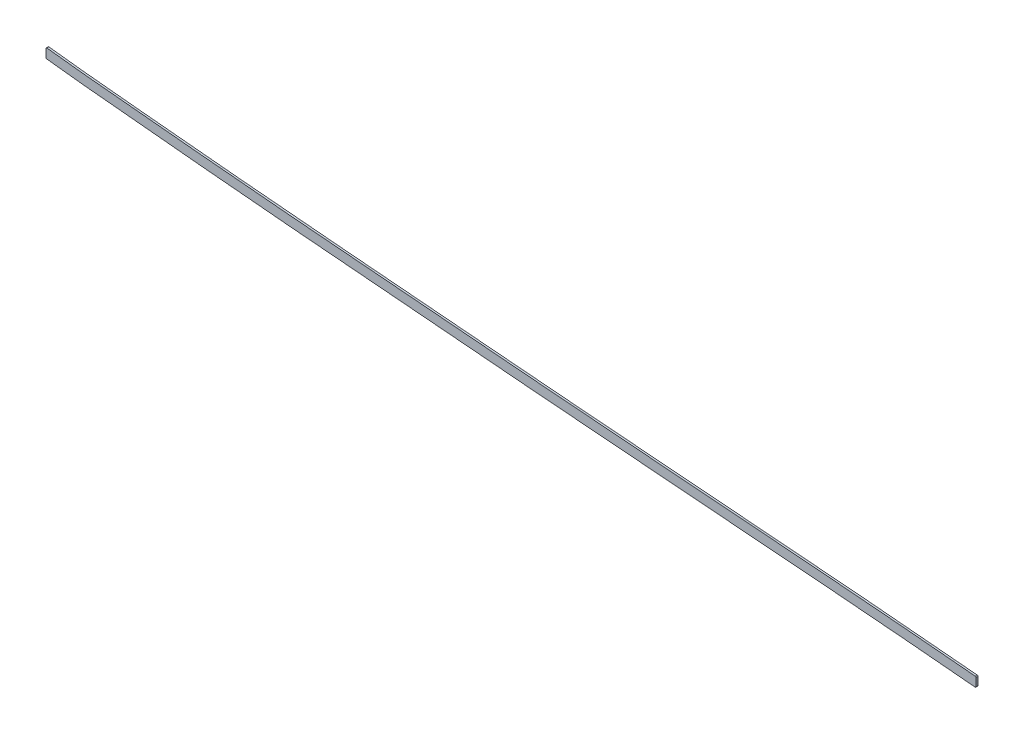
ISO-10303-21;
HEADER;
FILE_DESCRIPTION(('STEP AP214'),'2;1');
FILE_NAME('part.step','',(''),(''),'','','');
FILE_SCHEMA(('AUTOMOTIVE_DESIGN { 1 0 10303 214 1 1 1 1 }'));
ENDSEC;
DATA;
#1=APPLICATION_CONTEXT('core data for automotive mechanical design processes');
#2=APPLICATION_PROTOCOL_DEFINITION('international standard','automotive_design',2000,#1);
#3=PRODUCT_CONTEXT('',#1,'mechanical');
#4=PRODUCT('Part','Part','',(#3));
#5=PRODUCT_RELATED_PRODUCT_CATEGORY('part','',(#4));
#6=PRODUCT_DEFINITION_FORMATION('','',#4);
#7=PRODUCT_DEFINITION_CONTEXT('part definition',#1,'design');
#8=PRODUCT_DEFINITION('design','',#6,#7);
#9=PRODUCT_DEFINITION_SHAPE('','',#8);
#10=(LENGTH_UNIT() NAMED_UNIT(*) SI_UNIT(.MILLI.,.METRE.));
#11=(NAMED_UNIT(*) PLANE_ANGLE_UNIT() SI_UNIT($,.RADIAN.));
#12=(NAMED_UNIT(*) SI_UNIT($,.STERADIAN.) SOLID_ANGLE_UNIT());
#13=UNCERTAINTY_MEASURE_WITH_UNIT(LENGTH_MEASURE(1.E-05),#10,'distance_accuracy_value','');
#14=(GEOMETRIC_REPRESENTATION_CONTEXT(3) GLOBAL_UNCERTAINTY_ASSIGNED_CONTEXT((#13)) GLOBAL_UNIT_ASSIGNED_CONTEXT((#10,
#11,#12)) REPRESENTATION_CONTEXT('',''));
#15=CARTESIAN_POINT('',(0.,0.,0.));
#16=DIRECTION('',(0.,0.,1.));
#17=DIRECTION('',(1.,0.,0.));
#18=AXIS2_PLACEMENT_3D('',#15,#16,#17);
#19=CARTESIAN_POINT('',(825.5,-2.05798657070006E-12,1.5875));
#20=DIRECTION('',(1.,0.,0.));
#21=DIRECTION('',(0.,1.,0.));
#22=AXIS2_PLACEMENT_3D('',#19,#20,#21);
#23=PLANE('',#22);
#24=DIRECTION('',(0.,-1.,0.));
#25=VECTOR('',#24,1.);
#26=CARTESIAN_POINT('',(825.5,-2.05798657070006E-12,-1.5875));
#27=LINE('',#26,#25);
#28=CARTESIAN_POINT('',(825.5,262.285579233038,-1.5875));
#29=VERTEX_POINT('',#28);
#30=CARTESIAN_POINT('',(825.5,249.483474235144,-1.5875));
#31=VERTEX_POINT('',#30);
#32=EDGE_CURVE('E135',#29,#31,#27,.T.);
#33=ORIENTED_EDGE('',*,*,#32,.T.);
#34=DIRECTION('',(0.,0.,-1.));
#35=VECTOR('',#34,1.);
#36=CARTESIAN_POINT('',(825.5,249.483474235144,1.5875));
#37=LINE('',#36,#35);
#38=CARTESIAN_POINT('',(825.5,249.483474235144,1.5875));
#39=VERTEX_POINT('',#38);
#40=EDGE_CURVE('E11',#31,#39,#37,.F.);
#41=ORIENTED_EDGE('',*,*,#40,.T.);
#42=DIRECTION('',(0.,-1.,0.));
#43=VECTOR('',#42,1.);
#44=CARTESIAN_POINT('',(825.5,-2.05798657070006E-12,1.5875));
#45=LINE('',#44,#43);
#46=CARTESIAN_POINT('',(825.5,262.285579233038,1.5875));
#47=VERTEX_POINT('',#46);
#48=EDGE_CURVE('E198',#47,#39,#45,.T.);
#49=ORIENTED_EDGE('',*,*,#48,.F.);
#50=DIRECTION('',(0.,0.,1.));
#51=VECTOR('',#50,1.);
#52=CARTESIAN_POINT('',(825.5,262.285579233038,-1.5875));
#53=LINE('',#52,#51);
#54=EDGE_CURVE('E46',#47,#29,#53,.F.);
#55=ORIENTED_EDGE('',*,*,#54,.T.);
#56=EDGE_LOOP('',(#33,#41,#49,#55));
#57=FACE_BOUND('',#56,.T.);
#58=ADVANCED_FACE('F38',(#57),#23,.F.);
#59=CARTESIAN_POINT('',(816.035490090419,249.602504502473,1.5875));
#60=CARTESIAN_POINT('',(820.895958915978,248.948752998504,1.5875));
#61=CARTESIAN_POINT('',(830.611237516535,247.699685180795,1.5875));
#62=CARTESIAN_POINT('',(845.281067269815,245.953419482549,1.5875));
#63=CARTESIAN_POINT('',(860.086531547022,244.295598067093,1.5875));
#64=CARTESIAN_POINT('',(879.83070343434,242.186646027517,1.5875));
#65=CARTESIAN_POINT('',(904.36996709185,239.698279805688,1.5875));
#66=CARTESIAN_POINT('',(933.571022669327,236.832150625483,1.5875));
#67=CARTESIAN_POINT('',(962.642718040815,234.023667740898,1.5875));
#68=CARTESIAN_POINT('',(991.762593942944,231.241975908087,1.5875));
#69=CARTESIAN_POINT('',(1021.07201031471,228.475862291185,1.5875));
#70=CARTESIAN_POINT('',(1060.37643731472,224.796956681051,1.5875));
#71=CARTESIAN_POINT('',(1109.51301557685,220.18437886172,1.5875));
#72=CARTESIAN_POINT('',(1168.51119036116,214.817071985159,1.5875));
#73=CARTESIAN_POINT('',(1227.50012979269,209.662054041939,1.5875));
#74=CARTESIAN_POINT('',(1306.13316794657,203.021178328389,1.5875));
#75=CARTESIAN_POINT('',(1404.36147710547,194.920725932278,1.5875));
#76=CARTESIAN_POINT('',(1522.23985107062,184.918066624094,1.5875));
#77=CARTESIAN_POINT('',(1640.18285649102,175.16700778633,1.5875));
#78=CARTESIAN_POINT('',(1758.16535256682,165.7576394845,1.5875));
#79=CARTESIAN_POINT('',(1876.15538476943,156.590937078959,1.5875));
#80=CARTESIAN_POINT('',(1994.08749188002,147.453250142139,1.5875));
#81=CARTESIAN_POINT('',(2092.26869206097,139.624216053351,1.5875));
#82=CARTESIAN_POINT('',(2170.74802904205,133.07965672904,1.5875));
#83=CARTESIAN_POINT('',(2219.77173097685,128.842227835716,1.5875));
#84=CARTESIAN_POINT('',(2258.98398824696,125.347211495477,1.5875));
#85=CARTESIAN_POINT('',(2288.37945753647,122.670854497073,1.5875));
#86=CARTESIAN_POINT('',(2317.81224311603,119.931729386451,1.5875));
#87=CARTESIAN_POINT('',(2347.55150917161,117.100365282643,1.5875));
#88=CARTESIAN_POINT('',(2377.15989972739,114.210118529692,1.5875));
#89=CARTESIAN_POINT('',(2406.46965385077,111.268968010355,1.5875));
#90=CARTESIAN_POINT('',(2435.81832605954,108.240091266207,1.5875));
#91=CARTESIAN_POINT('',(2474.91392826886,104.090158094027,1.5875));
#92=CARTESIAN_POINT('',(2523.71623221738,98.6932837654834,1.5875));
#93=CARTESIAN_POINT('',(2582.04188116328,91.9122953054182,1.5875));
#94=CARTESIAN_POINT('',(2640.07521554125,84.8575618799937,1.5875));
#95=CARTESIAN_POINT('',(2678.57418525121,79.9813997136137,1.5875));
#96=CARTESIAN_POINT('',(2697.83785996013,77.4903351724698,1.5875));
#97=B_SPLINE_CURVE_WITH_KNOTS('',3,(#59,#60,#61,#62,#63,#64,#65,#66,#67,#68,#69,#70,#71,#72,#73,
#74,#75,#76,#77,#78,#79,#80,#81,#82,#83,#84,#85,#86,#87,#88,#89,#90,#91,#92,#93,#94,#95,#96),
.UNSPECIFIED.,.F.,.F.,(4,1,1,1,1,1,1,1,1,1,1,1,1,1,1,1,1,1,1,1,1,1,1,1,1,1,1,1,1,1,1,1,1,1,1,4),
(77.9308215150932,79.3861761032565,80.8415306914199,82.2968852795832,83.7522398677466,
86.6629490440732,89.5736582203999,92.4843673967266,95.3950765730532,98.3057857493799,
101.216494925707,107.03791327836,112.859331631013,118.680749983667,124.50216833632,
136.145005041627,147.787841746933,159.43067845224,171.073515157547,182.716351862853,
194.35918856816,206.002025273467,211.82344362612,217.644861978773,220.5555711551,
223.466280331427,226.376989507753,229.28769868408,232.198407860407,235.109117036733,
238.01982621306,240.930535389387,246.75195374204,252.573372094693,258.394790447347,264.2162088),.UNSPECIFIED.);
#98=DIRECTION('',(0.,0.,-1.));
#99=VECTOR('',#98,1.);
#100=SURFACE_OF_LINEAR_EXTRUSION('',#97,#99);
#101=CARTESIAN_POINT('',(816.035490090419,249.602504502473,-1.5875));
#102=CARTESIAN_POINT('',(820.895958915978,248.948752998504,-1.5875));
#103=CARTESIAN_POINT('',(830.611237516535,247.699685180795,-1.5875));
#104=CARTESIAN_POINT('',(845.281067269815,245.953419482549,-1.5875));
#105=CARTESIAN_POINT('',(860.086531547022,244.295598067093,-1.5875));
#106=CARTESIAN_POINT('',(879.83070343434,242.186646027517,-1.5875));
#107=CARTESIAN_POINT('',(904.36996709185,239.698279805688,-1.5875));
#108=CARTESIAN_POINT('',(933.571022669327,236.832150625483,-1.5875));
#109=CARTESIAN_POINT('',(962.642718040815,234.023667740898,-1.5875));
#110=CARTESIAN_POINT('',(991.762593942944,231.241975908087,-1.5875));
#111=CARTESIAN_POINT('',(1021.07201031471,228.475862291185,-1.5875));
#112=CARTESIAN_POINT('',(1060.37643731472,224.796956681051,-1.5875));
#113=CARTESIAN_POINT('',(1109.51301557685,220.18437886172,-1.5875));
#114=CARTESIAN_POINT('',(1168.51119036116,214.817071985159,-1.5875));
#115=CARTESIAN_POINT('',(1227.50012979269,209.662054041939,-1.5875));
#116=CARTESIAN_POINT('',(1306.13316794657,203.021178328389,-1.5875));
#117=CARTESIAN_POINT('',(1404.36147710547,194.920725932278,-1.5875));
#118=CARTESIAN_POINT('',(1522.23985107062,184.918066624094,-1.5875));
#119=CARTESIAN_POINT('',(1640.18285649102,175.16700778633,-1.5875));
#120=CARTESIAN_POINT('',(1758.16535256682,165.7576394845,-1.5875));
#121=CARTESIAN_POINT('',(1876.15538476943,156.590937078959,-1.5875));
#122=CARTESIAN_POINT('',(1994.08749188002,147.453250142139,-1.5875));
#123=CARTESIAN_POINT('',(2092.26869206097,139.624216053351,-1.5875));
#124=CARTESIAN_POINT('',(2170.74802904205,133.07965672904,-1.5875));
#125=CARTESIAN_POINT('',(2219.77173097685,128.842227835716,-1.5875));
#126=CARTESIAN_POINT('',(2258.98398824696,125.347211495477,-1.5875));
#127=CARTESIAN_POINT('',(2288.37945753647,122.670854497073,-1.5875));
#128=CARTESIAN_POINT('',(2317.81224311603,119.931729386451,-1.5875));
#129=CARTESIAN_POINT('',(2347.55150917161,117.100365282643,-1.5875));
#130=CARTESIAN_POINT('',(2377.15989972739,114.210118529692,-1.5875));
#131=CARTESIAN_POINT('',(2406.46965385077,111.268968010355,-1.5875));
#132=CARTESIAN_POINT('',(2435.81832605954,108.240091266207,-1.5875));
#133=CARTESIAN_POINT('',(2474.91392826886,104.090158094027,-1.5875));
#134=CARTESIAN_POINT('',(2523.71623221738,98.6932837654834,-1.5875));
#135=CARTESIAN_POINT('',(2582.04188116328,91.9122953054182,-1.5875));
#136=CARTESIAN_POINT('',(2640.07521554125,84.8575618799937,-1.5875));
#137=CARTESIAN_POINT('',(2678.57418525121,79.9813997136137,-1.5875));
#138=CARTESIAN_POINT('',(2697.83785996013,77.4903351724698,-1.5875));
#139=B_SPLINE_CURVE_WITH_KNOTS('',3,(#101,#102,#103,#104,#105,#106,#107,#108,#109,#110,#111,
#112,#113,#114,#115,#116,#117,#118,#119,#120,#121,#122,#123,#124,#125,#126,#127,#128,#129,#130,
#131,#132,#133,#134,#135,#136,#137,#138),.UNSPECIFIED.,.F.,.F.,(4,1,1,1,1,1,1,1,1,1,1,1,1,1,1,1,
1,1,1,1,1,1,1,1,1,1,1,1,1,1,1,1,1,1,1,4),(77.9308215150932,79.3861761032565,80.8415306914199,
82.2968852795832,83.7522398677466,86.6629490440732,89.5736582203999,92.4843673967266,
95.3950765730532,98.3057857493799,101.216494925707,107.03791327836,112.859331631013,
118.680749983667,124.50216833632,136.145005041627,147.787841746933,159.43067845224,
171.073515157547,182.716351862853,194.35918856816,206.002025273467,211.82344362612,
217.644861978773,220.5555711551,223.466280331427,226.376989507753,229.28769868408,
232.198407860407,235.109117036733,238.01982621306,240.930535389387,246.75195374204,
252.573372094693,258.394790447347,264.2162088),.UNSPECIFIED.);
#140=CARTESIAN_POINT('',(826.610616961591,248.223515090145,-1.5875));
#141=VERTEX_POINT('',#140);
#142=CARTESIAN_POINT('',(2310.01167690191,120.65328961223,-1.5875));
#143=VERTEX_POINT('',#142);
#144=EDGE_CURVE('E124',#141,#143,#139,.T.);
#145=ORIENTED_EDGE('',*,*,#144,.T.);
#146=DIRECTION('',(0.,0.,-1.));
#147=VECTOR('',#146,1.);
#148=CARTESIAN_POINT('',(2310.01167690191,120.65328961223,-1.5875));
#149=LINE('',#148,#147);
#150=CARTESIAN_POINT('',(2310.01167690191,120.65328961223,1.5875));
#151=VERTEX_POINT('',#150);
#152=EDGE_CURVE('E205',#143,#151,#149,.F.);
#153=ORIENTED_EDGE('',*,*,#152,.T.);
#154=CARTESIAN_POINT('',(826.610616961591,248.223515090145,1.5875));
#155=VERTEX_POINT('',#154);
#156=EDGE_CURVE('E171',#155,#151,#97,.T.);
#157=ORIENTED_EDGE('',*,*,#156,.F.);
#158=DIRECTION('',(0.,0.,-1.));
#159=VECTOR('',#158,1.);
#160=CARTESIAN_POINT('',(826.610616961591,248.223515090145,1.5875));
#161=LINE('',#160,#159);
#162=EDGE_CURVE('E240',#155,#141,#161,.T.);
#163=ORIENTED_EDGE('',*,*,#162,.T.);
#164=EDGE_LOOP('',(#145,#153,#157,#163));
#165=FACE_BOUND('',#164,.T.);
#166=ADVANCED_FACE('F245',(#165),#100,.F.);
#167=CARTESIAN_POINT('',(2311.39999999999,-5.80093407010283E-10,1.5875));
#168=DIRECTION('',(1.,-2.5097058363342E-13,0.));
#169=DIRECTION('',(2.5097058363342E-13,1.,0.));
#170=AXIS2_PLACEMENT_3D('',#167,#168,#169);
#171=PLANE('',#170);
#172=DIRECTION('',(-2.5097058363342E-13,-1.,0.));
#173=VECTOR('',#172,1.);
#174=CARTESIAN_POINT('',(2311.39999999999,-5.80093407010283E-10,1.5875));
#175=LINE('',#174,#173);
#176=CARTESIAN_POINT('',(2311.40000000002,134.673179719052,1.5875));
#177=VERTEX_POINT('',#176);
#178=CARTESIAN_POINT('',(2311.40000000002,121.917765647769,1.5875));
#179=VERTEX_POINT('',#178);
#180=EDGE_CURVE('E131',#177,#179,#175,.T.);
#181=ORIENTED_EDGE('',*,*,#180,.T.);
#182=DIRECTION('',(0.,0.,1.));
#183=VECTOR('',#182,1.);
#184=CARTESIAN_POINT('',(2311.40000000002,121.917765647769,-1.5875));
#185=LINE('',#184,#183);
#186=CARTESIAN_POINT('',(2311.40000000002,121.917765647769,-1.5875));
#187=VERTEX_POINT('',#186);
#188=EDGE_CURVE('E123',#179,#187,#185,.F.);
#189=ORIENTED_EDGE('',*,*,#188,.T.);
#190=DIRECTION('',(-2.5097058363342E-13,-1.,0.));
#191=VECTOR('',#190,1.);
#192=CARTESIAN_POINT('',(2311.39999999999,-5.80093407010283E-10,-1.5875));
#193=LINE('',#192,#191);
#194=CARTESIAN_POINT('',(2311.40000000002,134.673179719052,-1.5875));
#195=VERTEX_POINT('',#194);
#196=EDGE_CURVE('E107',#195,#187,#193,.T.);
#197=ORIENTED_EDGE('',*,*,#196,.F.);
#198=DIRECTION('',(0.,0.,-1.));
#199=VECTOR('',#198,1.);
#200=CARTESIAN_POINT('',(2311.40000000002,134.673179719052,1.5875));
#201=LINE('',#200,#199);
#202=EDGE_CURVE('E121',#195,#177,#201,.F.);
#203=ORIENTED_EDGE('',*,*,#202,.T.);
#204=EDGE_LOOP('',(#181,#189,#197,#203));
#205=FACE_BOUND('',#204,.T.);
#206=ADVANCED_FACE('F120',(#205),#171,.T.);
#207=CARTESIAN_POINT('',(818.067033698442,264.706491743222,1.5875));
#208=CARTESIAN_POINT('',(827.043059883077,263.499182154688,1.5875));
#209=CARTESIAN_POINT('',(836.029088262746,262.37336018535,1.5875));
#210=CARTESIAN_POINT('',(845.086758911477,261.305822737124,1.5875));
#211=CARTESIAN_POINT('',(891.386485356828,256.087047064925,1.5875));
#212=CARTESIAN_POINT('',(937.686211733138,251.779150949417,1.5875));
#213=CARTESIAN_POINT('',(973.452075064018,248.227669424888,1.5875));
#214=CARTESIAN_POINT('',(1071.94667214103,239.051054037575,1.5875));
#215=CARTESIAN_POINT('',(1170.4412693194,229.731506737662,1.5875));
#216=CARTESIAN_POINT('',(1231.79194034372,224.503945812963,1.5875));
#217=CARTESIAN_POINT('',(1324.89933614602,216.790627817024,1.5875));
#218=CARTESIAN_POINT('',(1418.00673093479,209.040117977579,1.5875));
#219=CARTESIAN_POINT('',(1449.7429359212,206.361809936344,1.5875));
#220=CARTESIAN_POINT('',(1636.92860677809,190.521130341518,1.5875));
#221=CARTESIAN_POINT('',(1824.11427763497,175.409157235081,1.5875));
#222=CARTESIAN_POINT('',(1979.96694737597,164.299650252625,1.5875));
#223=CARTESIAN_POINT('',(2156.26863942885,150.414433314205,1.5875));
#224=CARTESIAN_POINT('',(2332.5703304682,133.85721640186,1.5875));
#225=CARTESIAN_POINT('',(2354.21298315715,131.785082220072,1.5875));
#226=CARTESIAN_POINT('',(2436.3555443117,123.723952135345,1.5875));
#227=CARTESIAN_POINT('',(2518.49810546626,114.859112916573,1.5875));
#228=CARTESIAN_POINT('',(2579.48130742255,107.74251493933,1.5875));
#229=CARTESIAN_POINT('',(2639.63682069028,100.383443901382,1.5875));
#230=CARTESIAN_POINT('',(2699.79233294449,92.6044886503654,1.5875));
#231=(BOUNDED_CURVE() B_SPLINE_CURVE(5,(#207,#208,#209,#210,#211,#212,#213,#214,#215,#216,#217,
#218,#219,#220,#221,#222,#223,#224,#225,#226,#227,#228,#229,#230),.UNSPECIFIED.,.F.,
.F.) B_SPLINE_CURVE_WITH_KNOTS((6,3,3,3,3,3,3,6),(77.9308215150932,82.46579272,100.7932901,
131.0989539,146.7691983,223.5339586,233.9431167,264.2162088),
.UNSPECIFIED.) CURVE() GEOMETRIC_REPRESENTATION_ITEM() RATIONAL_B_SPLINE_CURVE((1.,1.,1.,1.,1.,
1.,1.,1.,1.,1.,1.,1.,1.,1.,1.,1.,1.,1.,1.,1.,1.,1.,1.,1.)) REPRESENTATION_ITEM(''));
#232=DIRECTION('',(0.,0.,-1.));
#233=VECTOR('',#232,1.);
#234=SURFACE_OF_LINEAR_EXTRUSION('',#231,#233);
#235=CARTESIAN_POINT('',(826.930793765664,263.545359120528,1.5875));
#236=CARTESIAN_POINT('',(834.15328230212,262.623506686326,1.5875));
#237=CARTESIAN_POINT('',(841.404336739596,261.74526194323,1.5875));
#238=CARTESIAN_POINT('',(848.710906506319,260.898714218686,1.5875));
#239=CARTESIAN_POINT('',(893.1985591516,255.918445082311,1.5875));
#240=CARTESIAN_POINT('',(937.686211733138,251.779150949417,1.5875));
#241=CARTESIAN_POINT('',(973.452075064018,248.227669424888,1.5875));
#242=CARTESIAN_POINT('',(1071.94667214103,239.051054037575,1.5875));
#243=CARTESIAN_POINT('',(1170.4412693194,229.731506737662,1.5875));
#244=CARTESIAN_POINT('',(1231.79194034372,224.503945812963,1.5875));
#245=CARTESIAN_POINT('',(1324.89933614602,216.790627817024,1.5875));
#246=CARTESIAN_POINT('',(1418.00673093479,209.040117977579,1.5875));
#247=CARTESIAN_POINT('',(1449.7429359212,206.361809936344,1.5875));
#248=CARTESIAN_POINT('',(1636.92860677809,190.521130341518,1.5875));
#249=CARTESIAN_POINT('',(1824.11427763497,175.409157235081,1.5875));
#250=CARTESIAN_POINT('',(1979.96694737597,164.299650252625,1.5875));
#251=CARTESIAN_POINT('',(2139.16750438068,151.761289191038,1.5875));
#252=CARTESIAN_POINT('',(2298.36806055896,137.044151769579,1.5875));
#253=CARTESIAN_POINT('',(2302.32245104841,136.677234897331,1.5875));
#254=CARTESIAN_POINT('',(2306.28241179502,136.308423635675,1.5875));
#255=CARTESIAN_POINT('',(2310.24821515963,135.937665850269,1.5875));
#256=(BOUNDED_CURVE() B_SPLINE_CURVE(5,(#235,#236,#237,#238,#239,#240,#241,#242,#243,#244,#245,
#246,#247,#248,#249,#250,#251,#252,#253,#254,#255),.UNSPECIFIED.,.F.,
.F.) B_SPLINE_CURVE_WITH_KNOTS((6,3,3,3,3,3,6),(78.8256103928888,82.46579272,100.7932901,
131.0989539,146.7691983,223.5339586,225.487310440415),
.UNSPECIFIED.) CURVE() GEOMETRIC_REPRESENTATION_ITEM() RATIONAL_B_SPLINE_CURVE((1.,1.,1.,1.,1.,
1.,1.,1.,1.,1.,1.,1.,1.,1.,1.,1.,1.,1.,1.,1.,1.)) REPRESENTATION_ITEM(''));
#257=CARTESIAN_POINT('',(826.930797227182,263.545386256239,1.5875));
#258=VERTEX_POINT('',#257);
#259=CARTESIAN_POINT('',(2310.24821506457,135.937664833471,1.5875));
#260=VERTEX_POINT('',#259);
#261=EDGE_CURVE('E127',#258,#260,#256,.T.);
#262=ORIENTED_EDGE('',*,*,#261,.T.);
#263=DIRECTION('',(0.,0.,-1.));
#264=VECTOR('',#263,1.);
#265=CARTESIAN_POINT('',(2310.24821515962,135.937665850269,1.5875));
#266=LINE('',#265,#264);
#267=CARTESIAN_POINT('',(2310.2482150646,135.937664833807,-1.5875));
#268=VERTEX_POINT('',#267);
#269=EDGE_CURVE('E215',#260,#268,#266,.T.);
#270=ORIENTED_EDGE('',*,*,#269,.T.);
#271=CARTESIAN_POINT('',(2310.24821515963,135.937665850268,-1.5875));
#272=CARTESIAN_POINT('',(2306.28241179503,136.308423635674,-1.5875));
#273=CARTESIAN_POINT('',(2302.32245104842,136.67723489733,-1.5875));
#274=CARTESIAN_POINT('',(2298.36806055896,137.044151769578,-1.5875));
#275=CARTESIAN_POINT('',(2139.16750438068,151.761289191038,-1.5875));
#276=CARTESIAN_POINT('',(1979.96694737597,164.299650252625,-1.5875));
#277=CARTESIAN_POINT('',(1824.11427763497,175.409157235081,-1.5875));
#278=CARTESIAN_POINT('',(1636.92860677809,190.521130341518,-1.5875));
#279=CARTESIAN_POINT('',(1449.7429359212,206.361809936344,-1.5875));
#280=CARTESIAN_POINT('',(1418.00673093479,209.040117977579,-1.5875));
#281=CARTESIAN_POINT('',(1324.89933614602,216.790627817024,-1.5875));
#282=CARTESIAN_POINT('',(1231.79194034372,224.503945812963,-1.5875));
#283=CARTESIAN_POINT('',(1170.4412693194,229.731506737662,-1.5875));
#284=CARTESIAN_POINT('',(1071.94667214103,239.051054037575,-1.5875));
#285=CARTESIAN_POINT('',(973.452075064018,248.227669424888,-1.5875));
#286=CARTESIAN_POINT('',(937.686211733138,251.779150949417,-1.5875));
#287=CARTESIAN_POINT('',(893.198559151539,255.918445082317,-1.5875));
#288=CARTESIAN_POINT('',(848.710906506197,260.8987142187,-1.5875));
#289=CARTESIAN_POINT('',(841.404336739416,261.745261943251,-1.5875));
#290=CARTESIAN_POINT('',(834.153282301881,262.623506686355,-1.5875));
#291=CARTESIAN_POINT('',(826.930793765367,263.545359120565,-1.5875));
#292=(BOUNDED_CURVE() B_SPLINE_CURVE(5,(#271,#272,#273,#274,#275,#276,#277,#278,#279,#280,#281,
#282,#283,#284,#285,#286,#287,#288,#289,#290,#291),.UNSPECIFIED.,.F.,
.F.) B_SPLINE_CURVE_WITH_KNOTS((6,3,3,3,3,3,6),(78.8256103928589,80.7789622332742,
157.543722533274,173.213966933274,203.519630733274,221.847128113274,225.487310440415),
.UNSPECIFIED.) CURVE() GEOMETRIC_REPRESENTATION_ITEM() RATIONAL_B_SPLINE_CURVE((1.,1.,1.,1.,1.,
1.,1.,1.,1.,1.,1.,1.,1.,1.,1.,1.,1.,1.,1.,1.,1.)) REPRESENTATION_ITEM(''));
#293=CARTESIAN_POINT('',(826.930797231308,263.545386275362,-1.5875));
#294=VERTEX_POINT('',#293);
#295=EDGE_CURVE('E108',#294,#268,#292,.F.);
#296=ORIENTED_EDGE('',*,*,#295,.F.);
#297=DIRECTION('',(0.,0.,-1.));
#298=VECTOR('',#297,1.);
#299=CARTESIAN_POINT('',(826.930793769284,263.545359120066,-1.5875));
#300=LINE('',#299,#298);
#301=EDGE_CURVE('E60',#294,#258,#300,.F.);
#302=ORIENTED_EDGE('',*,*,#301,.T.);
#303=EDGE_LOOP('',(#262,#270,#296,#302));
#304=FACE_BOUND('',#303,.T.);
#305=ADVANCED_FACE('F150',(#304),#234,.T.);
#306=CARTESIAN_POINT('',(0.,0.,1.5875));
#307=DIRECTION('',(0.,0.,1.));
#308=DIRECTION('',(1.,0.,0.));
#309=AXIS2_PLACEMENT_3D('',#306,#307,#308);
#310=PLANE('',#309);
#311=ORIENTED_EDGE('',*,*,#156,.T.);
#312=CARTESIAN_POINT('',(2310.13000000002,121.91776564777,1.5875));
#313=DIRECTION('',(0.,0.,1.));
#314=DIRECTION('',(1.,0.,0.));
#315=AXIS2_PLACEMENT_3D('',#312,#313,#314);
#316=CIRCLE('',#315,1.27);
#317=EDGE_CURVE('E210',#151,#179,#316,.T.);
#318=ORIENTED_EDGE('',*,*,#317,.T.);
#319=ORIENTED_EDGE('',*,*,#180,.F.);
#320=CARTESIAN_POINT('',(2310.13000000002,134.673179719052,1.5875));
#321=DIRECTION('',(0.,0.,1.));
#322=DIRECTION('',(1.,0.,0.));
#323=AXIS2_PLACEMENT_3D('',#320,#321,#322);
#324=CIRCLE('',#323,1.27);
#325=EDGE_CURVE('E53',#177,#260,#324,.T.);
#326=ORIENTED_EDGE('',*,*,#325,.T.);
#327=ORIENTED_EDGE('',*,*,#261,.F.);
#328=CARTESIAN_POINT('',(826.77,262.285579233038,1.5875));
#329=DIRECTION('',(0.,0.,1.));
#330=DIRECTION('',(1.,0.,0.));
#331=AXIS2_PLACEMENT_3D('',#328,#329,#330);
#332=CIRCLE('',#331,1.27);
#333=EDGE_CURVE('E202',#258,#47,#332,.T.);
#334=ORIENTED_EDGE('',*,*,#333,.T.);
#335=ORIENTED_EDGE('',*,*,#48,.T.);
#336=CARTESIAN_POINT('',(826.77,249.483474235144,1.5875));
#337=DIRECTION('',(0.,0.,1.));
#338=DIRECTION('',(1.,0.,0.));
#339=AXIS2_PLACEMENT_3D('',#336,#337,#338);
#340=CIRCLE('',#339,1.27);
#341=EDGE_CURVE('E204',#39,#155,#340,.T.);
#342=ORIENTED_EDGE('',*,*,#341,.T.);
#343=EDGE_LOOP('',(#311,#318,#319,#326,#327,#334,#335,#342));
#344=FACE_BOUND('',#343,.T.);
#345=ADVANCED_FACE('F160',(#344),#310,.T.);
#346=CARTESIAN_POINT('',(0.,0.,-1.5875));
#347=DIRECTION('',(0.,0.,1.));
#348=DIRECTION('',(1.,0.,0.));
#349=AXIS2_PLACEMENT_3D('',#346,#347,#348);
#350=PLANE('',#349);
#351=ORIENTED_EDGE('',*,*,#196,.T.);
#352=CARTESIAN_POINT('',(2310.13000000002,121.91776564777,-1.5875));
#353=DIRECTION('',(0.,0.,1.));
#354=DIRECTION('',(1.,0.,0.));
#355=AXIS2_PLACEMENT_3D('',#352,#353,#354);
#356=CIRCLE('',#355,1.27);
#357=EDGE_CURVE('E114',#187,#143,#356,.F.);
#358=ORIENTED_EDGE('',*,*,#357,.T.);
#359=ORIENTED_EDGE('',*,*,#144,.F.);
#360=CARTESIAN_POINT('',(826.77,249.483474235144,-1.5875));
#361=DIRECTION('',(0.,0.,1.));
#362=DIRECTION('',(1.,0.,0.));
#363=AXIS2_PLACEMENT_3D('',#360,#361,#362);
#364=CIRCLE('',#363,1.27);
#365=EDGE_CURVE('E115',#141,#31,#364,.F.);
#366=ORIENTED_EDGE('',*,*,#365,.T.);
#367=ORIENTED_EDGE('',*,*,#32,.F.);
#368=CARTESIAN_POINT('',(826.77,262.285579233038,-1.5875));
#369=DIRECTION('',(0.,0.,1.));
#370=DIRECTION('',(1.,0.,0.));
#371=AXIS2_PLACEMENT_3D('',#368,#369,#370);
#372=CIRCLE('',#371,1.27);
#373=EDGE_CURVE('E129',#29,#294,#372,.F.);
#374=ORIENTED_EDGE('',*,*,#373,.T.);
#375=ORIENTED_EDGE('',*,*,#295,.T.);
#376=CARTESIAN_POINT('',(2310.13000000002,134.673179719052,-1.5875));
#377=DIRECTION('',(0.,0.,1.));
#378=DIRECTION('',(1.,0.,0.));
#379=AXIS2_PLACEMENT_3D('',#376,#377,#378);
#380=CIRCLE('',#379,1.27);
#381=EDGE_CURVE('E104',#268,#195,#380,.F.);
#382=ORIENTED_EDGE('',*,*,#381,.T.);
#383=EDGE_LOOP('',(#351,#358,#359,#366,#367,#374,#375,#382));
#384=FACE_BOUND('',#383,.T.);
#385=ADVANCED_FACE('F106',(#384),#350,.F.);
#386=CARTESIAN_POINT('',(2310.13000000002,121.91776564777,0.));
#387=DIRECTION('',(0.,0.,-1.));
#388=DIRECTION('',(-1.,0.,0.));
#389=AXIS2_PLACEMENT_3D('',#386,#387,#388);
#390=CYLINDRICAL_SURFACE('',#389,1.27);
#391=ORIENTED_EDGE('',*,*,#317,.F.);
#392=ORIENTED_EDGE('',*,*,#152,.F.);
#393=ORIENTED_EDGE('',*,*,#357,.F.);
#394=ORIENTED_EDGE('',*,*,#188,.F.);
#395=EDGE_LOOP('',(#391,#392,#393,#394));
#396=FACE_BOUND('',#395,.T.);
#397=ADVANCED_FACE('F249',(#396),#390,.T.);
#398=CARTESIAN_POINT('',(2310.13000000002,134.673179719052,0.));
#399=DIRECTION('',(0.,0.,-1.));
#400=DIRECTION('',(-1.,0.,0.));
#401=AXIS2_PLACEMENT_3D('',#398,#399,#400);
#402=CYLINDRICAL_SURFACE('',#401,1.27);
#403=ORIENTED_EDGE('',*,*,#325,.F.);
#404=ORIENTED_EDGE('',*,*,#202,.F.);
#405=ORIENTED_EDGE('',*,*,#381,.F.);
#406=ORIENTED_EDGE('',*,*,#269,.F.);
#407=EDGE_LOOP('',(#403,#404,#405,#406));
#408=FACE_BOUND('',#407,.T.);
#409=ADVANCED_FACE('F126',(#408),#402,.T.);
#410=CARTESIAN_POINT('',(826.77,249.483474235144,0.));
#411=DIRECTION('',(0.,0.,-1.));
#412=DIRECTION('',(-1.,0.,0.));
#413=AXIS2_PLACEMENT_3D('',#410,#411,#412);
#414=CYLINDRICAL_SURFACE('',#413,1.27);
#415=ORIENTED_EDGE('',*,*,#341,.F.);
#416=ORIENTED_EDGE('',*,*,#40,.F.);
#417=ORIENTED_EDGE('',*,*,#365,.F.);
#418=ORIENTED_EDGE('',*,*,#162,.F.);
#419=EDGE_LOOP('',(#415,#416,#417,#418));
#420=FACE_BOUND('',#419,.T.);
#421=ADVANCED_FACE('F256',(#420),#414,.T.);
#422=CARTESIAN_POINT('',(826.77,262.285579233038,0.));
#423=DIRECTION('',(0.,0.,-1.));
#424=DIRECTION('',(-1.,0.,0.));
#425=AXIS2_PLACEMENT_3D('',#422,#423,#424);
#426=CYLINDRICAL_SURFACE('',#425,1.27);
#427=ORIENTED_EDGE('',*,*,#333,.F.);
#428=ORIENTED_EDGE('',*,*,#301,.F.);
#429=ORIENTED_EDGE('',*,*,#373,.F.);
#430=ORIENTED_EDGE('',*,*,#54,.F.);
#431=EDGE_LOOP('',(#427,#428,#429,#430));
#432=FACE_BOUND('',#431,.T.);
#433=ADVANCED_FACE('F40',(#432),#426,.T.);
#434=CLOSED_SHELL('',(#58,#166,#206,#305,#345,#385,#397,#409,#421,#433));
#435=MANIFOLD_SOLID_BREP('B2',#434);
#436=ADVANCED_BREP_SHAPE_REPRESENTATION('',(#18,#435),#14);
#437=SHAPE_DEFINITION_REPRESENTATION(#9,#436);
ENDSEC;
END-ISO-10303-21;
